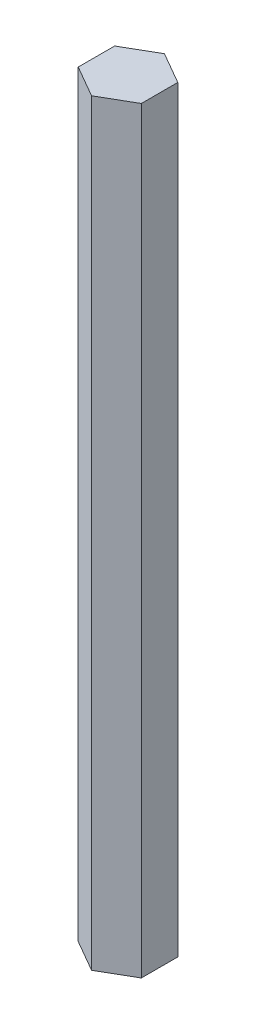
ISO-10303-21;
HEADER;
FILE_DESCRIPTION(('STEP AP214'),'2;1');
FILE_NAME('part.step','',(''),(''),'','','');
FILE_SCHEMA(('AUTOMOTIVE_DESIGN { 1 0 10303 214 1 1 1 1 }'));
ENDSEC;
DATA;
#1=APPLICATION_CONTEXT('core data for automotive mechanical design processes');
#2=APPLICATION_PROTOCOL_DEFINITION('international standard','automotive_design',2000,#1);
#3=PRODUCT_CONTEXT('',#1,'mechanical');
#4=PRODUCT('Part','Part','',(#3));
#5=PRODUCT_RELATED_PRODUCT_CATEGORY('part','',(#4));
#6=PRODUCT_DEFINITION_FORMATION('','',#4);
#7=PRODUCT_DEFINITION_CONTEXT('part definition',#1,'design');
#8=PRODUCT_DEFINITION('design','',#6,#7);
#9=PRODUCT_DEFINITION_SHAPE('','',#8);
#10=(LENGTH_UNIT() NAMED_UNIT(*) SI_UNIT(.MILLI.,.METRE.));
#11=(NAMED_UNIT(*) PLANE_ANGLE_UNIT() SI_UNIT($,.RADIAN.));
#12=(NAMED_UNIT(*) SI_UNIT($,.STERADIAN.) SOLID_ANGLE_UNIT());
#13=UNCERTAINTY_MEASURE_WITH_UNIT(LENGTH_MEASURE(1.E-05),#10,'distance_accuracy_value','');
#14=(GEOMETRIC_REPRESENTATION_CONTEXT(3) GLOBAL_UNCERTAINTY_ASSIGNED_CONTEXT((#13)) GLOBAL_UNIT_ASSIGNED_CONTEXT((#10,
#11,#12)) REPRESENTATION_CONTEXT('',''));
#15=CARTESIAN_POINT('',(0.,0.,0.));
#16=DIRECTION('',(0.,0.,1.));
#17=DIRECTION('',(1.,0.,0.));
#18=AXIS2_PLACEMENT_3D('',#15,#16,#17);
#19=CARTESIAN_POINT('',(6.35,152.4,3.66617420935412));
#20=DIRECTION('',(-1.,0.,0.));
#21=DIRECTION('',(0.,0.,1.));
#22=AXIS2_PLACEMENT_3D('',#19,#20,#21);
#23=PLANE('',#22);
#24=DIRECTION('',(0.,0.,-1.));
#25=VECTOR('',#24,1.);
#26=CARTESIAN_POINT('',(6.35,0.,3.66617420935412));
#27=LINE('',#26,#25);
#28=CARTESIAN_POINT('',(6.35,0.,3.66617420935412));
#29=VERTEX_POINT('',#28);
#30=CARTESIAN_POINT('',(6.35,0.,-3.66617420935412));
#31=VERTEX_POINT('',#30);
#32=EDGE_CURVE('E134',#29,#31,#27,.T.);
#33=ORIENTED_EDGE('',*,*,#32,.T.);
#34=DIRECTION('',(0.,-1.,0.));
#35=VECTOR('',#34,1.);
#36=CARTESIAN_POINT('',(6.35,152.4,-3.66617420935412));
#37=LINE('',#36,#35);
#38=CARTESIAN_POINT('',(6.35,152.4,-3.66617420935412));
#39=VERTEX_POINT('',#38);
#40=EDGE_CURVE('E11',#39,#31,#37,.T.);
#41=ORIENTED_EDGE('',*,*,#40,.F.);
#42=DIRECTION('',(0.,0.,-1.));
#43=VECTOR('',#42,1.);
#44=CARTESIAN_POINT('',(6.35,152.4,3.66617420935412));
#45=LINE('',#44,#43);
#46=CARTESIAN_POINT('',(6.35,152.4,3.66617420935412));
#47=VERTEX_POINT('',#46);
#48=EDGE_CURVE('E150',#47,#39,#45,.T.);
#49=ORIENTED_EDGE('',*,*,#48,.F.);
#50=DIRECTION('',(0.,-1.,0.));
#51=VECTOR('',#50,1.);
#52=CARTESIAN_POINT('',(6.35,152.4,3.66617420935412));
#53=LINE('',#52,#51);
#54=EDGE_CURVE('E130',#47,#29,#53,.T.);
#55=ORIENTED_EDGE('',*,*,#54,.T.);
#56=EDGE_LOOP('',(#33,#41,#49,#55));
#57=FACE_BOUND('',#56,.T.);
#58=ADVANCED_FACE('F45',(#57),#23,.F.);
#59=CARTESIAN_POINT('',(6.35,152.4,-3.66617420935412));
#60=DIRECTION('',(-0.5,0.,0.866025403784439));
#61=DIRECTION('',(0.866025403784439,0.,0.5));
#62=AXIS2_PLACEMENT_3D('',#59,#60,#61);
#63=PLANE('',#62);
#64=DIRECTION('',(-0.866025403784439,0.,-0.5));
#65=VECTOR('',#64,1.);
#66=CARTESIAN_POINT('',(6.35,0.,-3.66617420935412));
#67=LINE('',#66,#65);
#68=CARTESIAN_POINT('',(0.,0.,-7.33234841870825));
#69=VERTEX_POINT('',#68);
#70=EDGE_CURVE('E138',#31,#69,#67,.T.);
#71=ORIENTED_EDGE('',*,*,#70,.T.);
#72=DIRECTION('',(0.,-1.,0.));
#73=VECTOR('',#72,1.);
#74=CARTESIAN_POINT('',(0.,152.4,-7.33234841870825));
#75=LINE('',#74,#73);
#76=CARTESIAN_POINT('',(0.,152.4,-7.33234841870825));
#77=VERTEX_POINT('',#76);
#78=EDGE_CURVE('E54',#77,#69,#75,.T.);
#79=ORIENTED_EDGE('',*,*,#78,.F.);
#80=DIRECTION('',(-0.866025403784439,0.,-0.5));
#81=VECTOR('',#80,1.);
#82=CARTESIAN_POINT('',(6.35,152.4,-3.66617420935412));
#83=LINE('',#82,#81);
#84=EDGE_CURVE('E99',#39,#77,#83,.T.);
#85=ORIENTED_EDGE('',*,*,#84,.F.);
#86=ORIENTED_EDGE('',*,*,#40,.T.);
#87=EDGE_LOOP('',(#71,#79,#85,#86));
#88=FACE_BOUND('',#87,.T.);
#89=ADVANCED_FACE('F178',(#88),#63,.F.);
#90=CARTESIAN_POINT('',(0.,152.4,-7.33234841870825));
#91=DIRECTION('',(0.500000000000001,0.,0.866025403784438));
#92=DIRECTION('',(0.866025403784438,0.,-0.500000000000001));
#93=AXIS2_PLACEMENT_3D('',#90,#91,#92);
#94=PLANE('',#93);
#95=DIRECTION('',(-0.866025403784438,0.,0.500000000000001));
#96=VECTOR('',#95,1.);
#97=CARTESIAN_POINT('',(0.,0.,-7.33234841870825));
#98=LINE('',#97,#96);
#99=CARTESIAN_POINT('',(-6.35,0.,-3.66617420935412));
#100=VERTEX_POINT('',#99);
#101=EDGE_CURVE('E141',#69,#100,#98,.T.);
#102=ORIENTED_EDGE('',*,*,#101,.T.);
#103=DIRECTION('',(0.,-1.,0.));
#104=VECTOR('',#103,1.);
#105=CARTESIAN_POINT('',(-6.35,152.4,-3.66617420935412));
#106=LINE('',#105,#104);
#107=CARTESIAN_POINT('',(-6.35,152.4,-3.66617420935412));
#108=VERTEX_POINT('',#107);
#109=EDGE_CURVE('E123',#108,#100,#106,.T.);
#110=ORIENTED_EDGE('',*,*,#109,.F.);
#111=DIRECTION('',(-0.866025403784438,0.,0.500000000000001));
#112=VECTOR('',#111,1.);
#113=CARTESIAN_POINT('',(0.,152.4,-7.33234841870825));
#114=LINE('',#113,#112);
#115=EDGE_CURVE('E112',#77,#108,#114,.T.);
#116=ORIENTED_EDGE('',*,*,#115,.F.);
#117=ORIENTED_EDGE('',*,*,#78,.T.);
#118=EDGE_LOOP('',(#102,#110,#116,#117));
#119=FACE_BOUND('',#118,.T.);
#120=ADVANCED_FACE('F160',(#119),#94,.F.);
#121=CARTESIAN_POINT('',(-6.35,152.4,-3.66617420935412));
#122=DIRECTION('',(1.,0.,0.));
#123=DIRECTION('',(0.,0.,-1.));
#124=AXIS2_PLACEMENT_3D('',#121,#122,#123);
#125=PLANE('',#124);
#126=DIRECTION('',(0.,0.,1.));
#127=VECTOR('',#126,1.);
#128=CARTESIAN_POINT('',(-6.35,0.,-3.66617420935412));
#129=LINE('',#128,#127);
#130=CARTESIAN_POINT('',(-6.35,0.,3.66617420935413));
#131=VERTEX_POINT('',#130);
#132=EDGE_CURVE('E121',#100,#131,#129,.T.);
#133=ORIENTED_EDGE('',*,*,#132,.T.);
#134=DIRECTION('',(0.,-1.,0.));
#135=VECTOR('',#134,1.);
#136=CARTESIAN_POINT('',(-6.35,152.4,3.66617420935413));
#137=LINE('',#136,#135);
#138=CARTESIAN_POINT('',(-6.35,152.4,3.66617420935413));
#139=VERTEX_POINT('',#138);
#140=EDGE_CURVE('E118',#139,#131,#137,.T.);
#141=ORIENTED_EDGE('',*,*,#140,.F.);
#142=DIRECTION('',(0.,0.,1.));
#143=VECTOR('',#142,1.);
#144=CARTESIAN_POINT('',(-6.35,152.4,-3.66617420935412));
#145=LINE('',#144,#143);
#146=EDGE_CURVE('E106',#108,#139,#145,.T.);
#147=ORIENTED_EDGE('',*,*,#146,.F.);
#148=ORIENTED_EDGE('',*,*,#109,.T.);
#149=EDGE_LOOP('',(#133,#141,#147,#148));
#150=FACE_BOUND('',#149,.T.);
#151=ADVANCED_FACE('F119',(#150),#125,.F.);
#152=CARTESIAN_POINT('',(-6.35,152.4,3.66617420935413));
#153=DIRECTION('',(0.5,0.,-0.866025403784439));
#154=DIRECTION('',(-0.866025403784439,0.,-0.5));
#155=AXIS2_PLACEMENT_3D('',#152,#153,#154);
#156=PLANE('',#155);
#157=DIRECTION('',(0.866025403784439,0.,0.5));
#158=VECTOR('',#157,1.);
#159=CARTESIAN_POINT('',(-6.35,0.,3.66617420935413));
#160=LINE('',#159,#158);
#161=CARTESIAN_POINT('',(0.,0.,7.33234841870825));
#162=VERTEX_POINT('',#161);
#163=EDGE_CURVE('E85',#131,#162,#160,.T.);
#164=ORIENTED_EDGE('',*,*,#163,.T.);
#165=DIRECTION('',(0.,-1.,0.));
#166=VECTOR('',#165,1.);
#167=CARTESIAN_POINT('',(0.,152.4,7.33234841870825));
#168=LINE('',#167,#166);
#169=CARTESIAN_POINT('',(0.,152.4,7.33234841870825));
#170=VERTEX_POINT('',#169);
#171=EDGE_CURVE('E124',#170,#162,#168,.T.);
#172=ORIENTED_EDGE('',*,*,#171,.F.);
#173=DIRECTION('',(0.866025403784439,0.,0.5));
#174=VECTOR('',#173,1.);
#175=CARTESIAN_POINT('',(-6.35,152.4,3.66617420935413));
#176=LINE('',#175,#174);
#177=EDGE_CURVE('E110',#139,#170,#176,.T.);
#178=ORIENTED_EDGE('',*,*,#177,.F.);
#179=ORIENTED_EDGE('',*,*,#140,.T.);
#180=EDGE_LOOP('',(#164,#172,#178,#179));
#181=FACE_BOUND('',#180,.T.);
#182=ADVANCED_FACE('F126',(#181),#156,.F.);
#183=CARTESIAN_POINT('',(0.,152.4,7.33234841870825));
#184=DIRECTION('',(-0.500000000000001,0.,-0.866025403784438));
#185=DIRECTION('',(-0.866025403784438,0.,0.500000000000001));
#186=AXIS2_PLACEMENT_3D('',#183,#184,#185);
#187=PLANE('',#186);
#188=DIRECTION('',(0.866025403784438,0.,-0.500000000000001));
#189=VECTOR('',#188,1.);
#190=CARTESIAN_POINT('',(0.,0.,7.33234841870825));
#191=LINE('',#190,#189);
#192=EDGE_CURVE('E91',#162,#29,#191,.T.);
#193=ORIENTED_EDGE('',*,*,#192,.T.);
#194=ORIENTED_EDGE('',*,*,#54,.F.);
#195=DIRECTION('',(0.866025403784438,0.,-0.500000000000001));
#196=VECTOR('',#195,1.);
#197=CARTESIAN_POINT('',(0.,152.4,7.33234841870825));
#198=LINE('',#197,#196);
#199=EDGE_CURVE('E62',#170,#47,#198,.T.);
#200=ORIENTED_EDGE('',*,*,#199,.F.);
#201=ORIENTED_EDGE('',*,*,#171,.T.);
#202=EDGE_LOOP('',(#193,#194,#200,#201));
#203=FACE_BOUND('',#202,.T.);
#204=ADVANCED_FACE('F167',(#203),#187,.F.);
#205=CARTESIAN_POINT('',(0.,152.4,0.));
#206=DIRECTION('',(0.,1.,0.));
#207=DIRECTION('',(0.,0.,1.));
#208=AXIS2_PLACEMENT_3D('',#205,#206,#207);
#209=PLANE('',#208);
#210=ORIENTED_EDGE('',*,*,#48,.T.);
#211=ORIENTED_EDGE('',*,*,#84,.T.);
#212=ORIENTED_EDGE('',*,*,#115,.T.);
#213=ORIENTED_EDGE('',*,*,#146,.T.);
#214=ORIENTED_EDGE('',*,*,#177,.T.);
#215=ORIENTED_EDGE('',*,*,#199,.T.);
#216=EDGE_LOOP('',(#210,#211,#212,#213,#214,#215));
#217=FACE_BOUND('',#216,.T.);
#218=ADVANCED_FACE('F108',(#217),#209,.T.);
#219=CARTESIAN_POINT('',(0.,0.,0.));
#220=DIRECTION('',(0.,1.,0.));
#221=DIRECTION('',(0.,0.,1.));
#222=AXIS2_PLACEMENT_3D('',#219,#220,#221);
#223=PLANE('',#222);
#224=ORIENTED_EDGE('',*,*,#32,.F.);
#225=ORIENTED_EDGE('',*,*,#192,.F.);
#226=ORIENTED_EDGE('',*,*,#163,.F.);
#227=ORIENTED_EDGE('',*,*,#132,.F.);
#228=ORIENTED_EDGE('',*,*,#101,.F.);
#229=ORIENTED_EDGE('',*,*,#70,.F.);
#230=EDGE_LOOP('',(#224,#225,#226,#227,#228,#229));
#231=FACE_BOUND('',#230,.T.);
#232=ADVANCED_FACE('F163',(#231),#223,.F.);
#233=CLOSED_SHELL('',(#58,#89,#120,#151,#182,#204,#218,#232));
#234=MANIFOLD_SOLID_BREP('B2',#233);
#235=ADVANCED_BREP_SHAPE_REPRESENTATION('',(#18,#234),#14);
#236=SHAPE_DEFINITION_REPRESENTATION(#9,#235);
ENDSEC;
END-ISO-10303-21;
